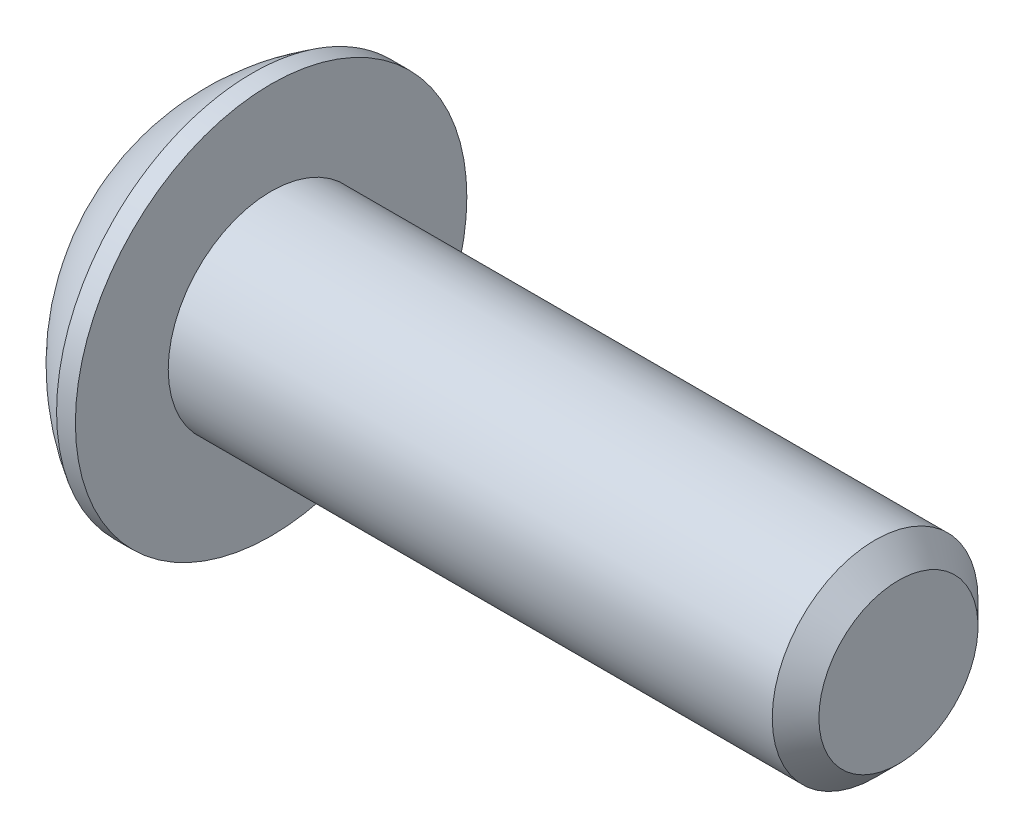
ISO-10303-21;
HEADER;
FILE_DESCRIPTION(('STEP AP214'),'2;1');
FILE_NAME('part.step','',(''),(''),'','','');
FILE_SCHEMA(('AUTOMOTIVE_DESIGN { 1 0 10303 214 1 1 1 1 }'));
ENDSEC;
DATA;
#1=APPLICATION_CONTEXT('core data for automotive mechanical design processes');
#2=APPLICATION_PROTOCOL_DEFINITION('international standard','automotive_design',2000,#1);
#3=PRODUCT_CONTEXT('',#1,'mechanical');
#4=PRODUCT('Part','Part','',(#3));
#5=PRODUCT_RELATED_PRODUCT_CATEGORY('part','',(#4));
#6=PRODUCT_DEFINITION_FORMATION('','',#4);
#7=PRODUCT_DEFINITION_CONTEXT('part definition',#1,'design');
#8=PRODUCT_DEFINITION('design','',#6,#7);
#9=PRODUCT_DEFINITION_SHAPE('','',#8);
#10=(LENGTH_UNIT() NAMED_UNIT(*) SI_UNIT(.MILLI.,.METRE.));
#11=(NAMED_UNIT(*) PLANE_ANGLE_UNIT() SI_UNIT($,.RADIAN.));
#12=(NAMED_UNIT(*) SI_UNIT($,.STERADIAN.) SOLID_ANGLE_UNIT());
#13=UNCERTAINTY_MEASURE_WITH_UNIT(LENGTH_MEASURE(1.E-05),#10,'distance_accuracy_value','');
#14=(GEOMETRIC_REPRESENTATION_CONTEXT(3) GLOBAL_UNCERTAINTY_ASSIGNED_CONTEXT((#13)) GLOBAL_UNIT_ASSIGNED_CONTEXT((#10,
#11,#12)) REPRESENTATION_CONTEXT('',''));
#15=CARTESIAN_POINT('',(0.,0.,0.));
#16=DIRECTION('',(0.,0.,1.));
#17=DIRECTION('',(1.,0.,0.));
#18=AXIS2_PLACEMENT_3D('',#15,#16,#17);
#19=CARTESIAN_POINT('',(1.32080000000034,0.,0.));
#20=DIRECTION('',(-1.,0.,0.));
#21=DIRECTION('',(0.,0.,1.));
#22=AXIS2_PLACEMENT_3D('',#19,#20,#21);
#23=CONICAL_SURFACE('',#22,1.1937999999998,1.04719755119608);
#24=CARTESIAN_POINT('',(2.01004075135902,0.,4.44089209850063E-13));
#25=VERTEX_POINT('',#24);
#26=VERTEX_LOOP('',#25);
#27=FACE_BOUND('',#26,.T.);
#28=CARTESIAN_POINT('',(1.32080000000009,0.,0.));
#29=DIRECTION('',(-1.,0.,0.));
#30=DIRECTION('',(0.,0.,1.));
#31=AXIS2_PLACEMENT_3D('',#28,#29,#30);
#32=CIRCLE('',#31,1.19380000000024);
#33=CARTESIAN_POINT('',(1.32080000000004,0.,1.19380000000012));
#34=VERTEX_POINT('',#33);
#35=CARTESIAN_POINT('',(1.32080000000004,-1.03386112703797,0.596900000000061));
#36=VERTEX_POINT('',#35);
#37=EDGE_CURVE('E20',#34,#36,#32,.F.);
#38=ORIENTED_EDGE('',*,*,#37,.F.);
#39=CARTESIAN_POINT('',(1.32080000000009,0.,0.));
#40=DIRECTION('',(-1.,0.,0.));
#41=DIRECTION('',(0.,0.,1.));
#42=AXIS2_PLACEMENT_3D('',#39,#40,#41);
#43=CIRCLE('',#42,1.19380000000024);
#44=CARTESIAN_POINT('',(1.32080000000004,1.03386112703797,0.596900000000063));
#45=VERTEX_POINT('',#44);
#46=EDGE_CURVE('E90',#45,#34,#43,.F.);
#47=ORIENTED_EDGE('',*,*,#46,.F.);
#48=CARTESIAN_POINT('',(1.32080000000009,0.,0.));
#49=DIRECTION('',(-1.,0.,0.));
#50=DIRECTION('',(0.,0.,1.));
#51=AXIS2_PLACEMENT_3D('',#48,#49,#50);
#52=CIRCLE('',#51,1.19380000000024);
#53=CARTESIAN_POINT('',(1.32080000000004,1.03386112703797,-0.596900000000063));
#54=VERTEX_POINT('',#53);
#55=EDGE_CURVE('E106',#54,#45,#52,.F.);
#56=ORIENTED_EDGE('',*,*,#55,.F.);
#57=CARTESIAN_POINT('',(1.32080000000009,0.,0.));
#58=DIRECTION('',(-1.,0.,0.));
#59=DIRECTION('',(0.,0.,1.));
#60=AXIS2_PLACEMENT_3D('',#57,#58,#59);
#61=CIRCLE('',#60,1.19380000000024);
#62=CARTESIAN_POINT('',(1.32080000000004,1.49420287879031E-12,-1.19380000000012));
#63=VERTEX_POINT('',#62);
#64=EDGE_CURVE('E449',#63,#54,#61,.F.);
#65=ORIENTED_EDGE('',*,*,#64,.F.);
#66=CARTESIAN_POINT('',(1.32080000000009,0.,0.));
#67=DIRECTION('',(-1.,0.,0.));
#68=DIRECTION('',(0.,0.,1.));
#69=AXIS2_PLACEMENT_3D('',#66,#67,#68);
#70=CIRCLE('',#69,1.19380000000024);
#71=CARTESIAN_POINT('',(1.32080000000004,-1.03386112703797,-0.596900000000062));
#72=VERTEX_POINT('',#71);
#73=EDGE_CURVE('E452',#72,#63,#70,.F.);
#74=ORIENTED_EDGE('',*,*,#73,.F.);
#75=CARTESIAN_POINT('',(1.32080000000009,0.,0.));
#76=DIRECTION('',(-1.,0.,0.));
#77=DIRECTION('',(0.,0.,1.));
#78=AXIS2_PLACEMENT_3D('',#75,#76,#77);
#79=CIRCLE('',#78,1.19380000000024);
#80=EDGE_CURVE('E93',#36,#72,#79,.F.);
#81=ORIENTED_EDGE('',*,*,#80,.F.);
#82=EDGE_LOOP('',(#38,#47,#56,#65,#74,#81));
#83=FACE_BOUND('',#82,.T.);
#84=ADVANCED_FACE('F17',(#27,#83),#23,.F.);
#85=CARTESIAN_POINT('',(1.3208,0.,2.3876));
#86=DIRECTION('',(-1.,0.,0.));
#87=DIRECTION('',(0.,0.,1.));
#88=AXIS2_PLACEMENT_3D('',#85,#86,#87);
#89=PLANE('',#88);
#90=DIRECTION('',(0.,1.,0.));
#91=VECTOR('',#90,1.);
#92=CARTESIAN_POINT('',(1.3208,-0.689240751358576,1.1938));
#93=LINE('',#92,#91);
#94=CARTESIAN_POINT('',(1.3208,-0.689240751358576,1.1938));
#95=VERTEX_POINT('',#94);
#96=EDGE_CURVE('E109',#34,#95,#93,.F.);
#97=ORIENTED_EDGE('',*,*,#96,.F.);
#98=ORIENTED_EDGE('',*,*,#37,.T.);
#99=DIRECTION('',(0.,0.5,0.866025403784439));
#100=VECTOR('',#99,1.);
#101=CARTESIAN_POINT('',(1.3208,-1.37848150271715,0.));
#102=LINE('',#101,#100);
#103=EDGE_CURVE('E112',#95,#36,#102,.F.);
#104=ORIENTED_EDGE('',*,*,#103,.F.);
#105=EDGE_LOOP('',(#97,#98,#104));
#106=FACE_BOUND('',#105,.T.);
#107=ADVANCED_FACE('F110',(#106),#89,.T.);
#108=CARTESIAN_POINT('',(1.3208,0.,2.3876));
#109=DIRECTION('',(-1.,0.,0.));
#110=DIRECTION('',(0.,0.,1.));
#111=AXIS2_PLACEMENT_3D('',#108,#109,#110);
#112=PLANE('',#111);
#113=DIRECTION('',(0.,0.5,0.866025403784439));
#114=VECTOR('',#113,1.);
#115=CARTESIAN_POINT('',(1.3208,-1.37848150271715,0.));
#116=LINE('',#115,#114);
#117=CARTESIAN_POINT('',(1.3208,-1.37848150271715,0.));
#118=VERTEX_POINT('',#117);
#119=EDGE_CURVE('E172',#36,#118,#116,.F.);
#120=ORIENTED_EDGE('',*,*,#119,.F.);
#121=ORIENTED_EDGE('',*,*,#80,.T.);
#122=DIRECTION('',(0.,-0.5,0.866025403784439));
#123=VECTOR('',#122,1.);
#124=CARTESIAN_POINT('',(1.3208,-0.689240751358576,-1.1938));
#125=LINE('',#124,#123);
#126=EDGE_CURVE('E160',#118,#72,#125,.F.);
#127=ORIENTED_EDGE('',*,*,#126,.F.);
#128=EDGE_LOOP('',(#120,#121,#127));
#129=FACE_BOUND('',#128,.T.);
#130=ADVANCED_FACE('F249',(#129),#112,.T.);
#131=CARTESIAN_POINT('',(1.3208,0.,2.3876));
#132=DIRECTION('',(-1.,0.,0.));
#133=DIRECTION('',(0.,0.,1.));
#134=AXIS2_PLACEMENT_3D('',#131,#132,#133);
#135=PLANE('',#134);
#136=DIRECTION('',(0.,-0.5,0.866025403784439));
#137=VECTOR('',#136,1.);
#138=CARTESIAN_POINT('',(1.3208,-0.689240751358576,-1.1938));
#139=LINE('',#138,#137);
#140=CARTESIAN_POINT('',(1.3208,-0.689240751358576,-1.1938));
#141=VERTEX_POINT('',#140);
#142=EDGE_CURVE('E157',#72,#141,#139,.F.);
#143=ORIENTED_EDGE('',*,*,#142,.F.);
#144=ORIENTED_EDGE('',*,*,#73,.T.);
#145=DIRECTION('',(0.,-1.,0.));
#146=VECTOR('',#145,1.);
#147=CARTESIAN_POINT('',(1.3208,0.689240751358575,-1.1938));
#148=LINE('',#147,#146);
#149=EDGE_CURVE('E144',#141,#63,#148,.F.);
#150=ORIENTED_EDGE('',*,*,#149,.F.);
#151=EDGE_LOOP('',(#143,#144,#150));
#152=FACE_BOUND('',#151,.T.);
#153=ADVANCED_FACE('F245',(#152),#135,.T.);
#154=CARTESIAN_POINT('',(1.3208,0.,2.3876));
#155=DIRECTION('',(-1.,0.,0.));
#156=DIRECTION('',(0.,0.,1.));
#157=AXIS2_PLACEMENT_3D('',#154,#155,#156);
#158=PLANE('',#157);
#159=DIRECTION('',(0.,-1.,0.));
#160=VECTOR('',#159,1.);
#161=CARTESIAN_POINT('',(1.3208,0.689240751358575,-1.1938));
#162=LINE('',#161,#160);
#163=CARTESIAN_POINT('',(1.3208,0.689240751358575,-1.1938));
#164=VERTEX_POINT('',#163);
#165=EDGE_CURVE('E141',#63,#164,#162,.F.);
#166=ORIENTED_EDGE('',*,*,#165,.F.);
#167=ORIENTED_EDGE('',*,*,#64,.T.);
#168=DIRECTION('',(0.,-0.500000000000001,-0.866025403784438));
#169=VECTOR('',#168,1.);
#170=CARTESIAN_POINT('',(1.3208,1.37848150271715,0.));
#171=LINE('',#170,#169);
#172=EDGE_CURVE('E129',#164,#54,#171,.F.);
#173=ORIENTED_EDGE('',*,*,#172,.F.);
#174=EDGE_LOOP('',(#166,#167,#173));
#175=FACE_BOUND('',#174,.T.);
#176=ADVANCED_FACE('F241',(#175),#158,.T.);
#177=CARTESIAN_POINT('',(1.3208,0.,2.3876));
#178=DIRECTION('',(-1.,0.,0.));
#179=DIRECTION('',(0.,0.,1.));
#180=AXIS2_PLACEMENT_3D('',#177,#178,#179);
#181=PLANE('',#180);
#182=DIRECTION('',(0.,-0.500000000000001,-0.866025403784438));
#183=VECTOR('',#182,1.);
#184=CARTESIAN_POINT('',(1.3208,1.37848150271715,0.));
#185=LINE('',#184,#183);
#186=CARTESIAN_POINT('',(1.3208,1.37848150271715,0.));
#187=VERTEX_POINT('',#186);
#188=EDGE_CURVE('E126',#54,#187,#185,.F.);
#189=ORIENTED_EDGE('',*,*,#188,.F.);
#190=ORIENTED_EDGE('',*,*,#55,.T.);
#191=DIRECTION('',(0.,0.500000000000001,-0.866025403784438));
#192=VECTOR('',#191,1.);
#193=CARTESIAN_POINT('',(1.3208,0.689240751358575,1.1938));
#194=LINE('',#193,#192);
#195=EDGE_CURVE('E149',#187,#45,#194,.F.);
#196=ORIENTED_EDGE('',*,*,#195,.F.);
#197=EDGE_LOOP('',(#189,#190,#196));
#198=FACE_BOUND('',#197,.T.);
#199=ADVANCED_FACE('F238',(#198),#181,.T.);
#200=CARTESIAN_POINT('',(1.3208,0.,2.3876));
#201=DIRECTION('',(-1.,0.,0.));
#202=DIRECTION('',(0.,0.,1.));
#203=AXIS2_PLACEMENT_3D('',#200,#201,#202);
#204=PLANE('',#203);
#205=DIRECTION('',(0.,0.500000000000001,-0.866025403784438));
#206=VECTOR('',#205,1.);
#207=CARTESIAN_POINT('',(1.3208,0.689240751358575,1.1938));
#208=LINE('',#207,#206);
#209=CARTESIAN_POINT('',(1.3208,0.689240751358575,1.1938));
#210=VERTEX_POINT('',#209);
#211=EDGE_CURVE('E104',#45,#210,#208,.F.);
#212=ORIENTED_EDGE('',*,*,#211,.F.);
#213=ORIENTED_EDGE('',*,*,#46,.T.);
#214=DIRECTION('',(0.,1.,0.));
#215=VECTOR('',#214,1.);
#216=CARTESIAN_POINT('',(1.3208,-0.689240751358576,1.1938));
#217=LINE('',#216,#215);
#218=EDGE_CURVE('E101',#210,#34,#217,.F.);
#219=ORIENTED_EDGE('',*,*,#218,.F.);
#220=EDGE_LOOP('',(#212,#213,#219));
#221=FACE_BOUND('',#220,.T.);
#222=ADVANCED_FACE('F99',(#221),#204,.T.);
#223=CARTESIAN_POINT('',(1.3208,-0.689240751358576,1.1938));
#224=DIRECTION('',(0.,0.,-1.));
#225=DIRECTION('',(0.,1.,0.));
#226=AXIS2_PLACEMENT_3D('',#223,#224,#225);
#227=PLANE('',#226);
#228=DIRECTION('',(0.,1.,0.));
#229=VECTOR('',#228,1.);
#230=CARTESIAN_POINT('',(0.,0.,1.1938));
#231=LINE('',#230,#229);
#232=CARTESIAN_POINT('',(0.,0.689240751358575,1.1938));
#233=VERTEX_POINT('',#232);
#234=CARTESIAN_POINT('',(0.,-0.689240751358576,1.1938));
#235=VERTEX_POINT('',#234);
#236=EDGE_CURVE('E133',#233,#235,#231,.F.);
#237=ORIENTED_EDGE('',*,*,#236,.F.);
#238=DIRECTION('',(1.,0.,0.));
#239=VECTOR('',#238,1.);
#240=CARTESIAN_POINT('',(1.3208,0.689240751358575,1.1938));
#241=LINE('',#240,#239);
#242=EDGE_CURVE('E118',#210,#233,#241,.F.);
#243=ORIENTED_EDGE('',*,*,#242,.F.);
#244=ORIENTED_EDGE('',*,*,#218,.T.);
#245=ORIENTED_EDGE('',*,*,#96,.T.);
#246=DIRECTION('',(1.,0.,0.));
#247=VECTOR('',#246,1.);
#248=CARTESIAN_POINT('',(1.3208,-0.689240751358576,1.1938));
#249=LINE('',#248,#247);
#250=EDGE_CURVE('E169',#235,#95,#249,.T.);
#251=ORIENTED_EDGE('',*,*,#250,.F.);
#252=EDGE_LOOP('',(#237,#243,#244,#245,#251));
#253=FACE_BOUND('',#252,.T.);
#254=ADVANCED_FACE('F116',(#253),#227,.T.);
#255=CARTESIAN_POINT('',(1.3208,-1.37848150271715,0.));
#256=DIRECTION('',(0.,0.866025403784439,-0.5));
#257=DIRECTION('',(0.,0.5,0.866025403784439));
#258=AXIS2_PLACEMENT_3D('',#255,#256,#257);
#259=PLANE('',#258);
#260=DIRECTION('',(0.,-0.5,-0.866025403784439));
#261=VECTOR('',#260,1.);
#262=CARTESIAN_POINT('',(0.,-0.689240751358576,1.1938));
#263=LINE('',#262,#261);
#264=CARTESIAN_POINT('',(0.,-1.37848150271715,0.));
#265=VERTEX_POINT('',#264);
#266=EDGE_CURVE('E436',#235,#265,#263,.T.);
#267=ORIENTED_EDGE('',*,*,#266,.F.);
#268=ORIENTED_EDGE('',*,*,#250,.T.);
#269=ORIENTED_EDGE('',*,*,#103,.T.);
#270=ORIENTED_EDGE('',*,*,#119,.T.);
#271=DIRECTION('',(1.,0.,0.));
#272=VECTOR('',#271,1.);
#273=CARTESIAN_POINT('',(1.3208,-1.37848150271715,0.));
#274=LINE('',#273,#272);
#275=EDGE_CURVE('E154',#265,#118,#274,.T.);
#276=ORIENTED_EDGE('',*,*,#275,.F.);
#277=EDGE_LOOP('',(#267,#268,#269,#270,#276));
#278=FACE_BOUND('',#277,.T.);
#279=ADVANCED_FACE('F229',(#278),#259,.T.);
#280=CARTESIAN_POINT('',(1.3208,-0.689240751358576,-1.1938));
#281=DIRECTION('',(0.,0.866025403784439,0.5));
#282=DIRECTION('',(0.,-0.5,0.866025403784439));
#283=AXIS2_PLACEMENT_3D('',#280,#281,#282);
#284=PLANE('',#283);
#285=DIRECTION('',(0.,0.5,-0.866025403784439));
#286=VECTOR('',#285,1.);
#287=CARTESIAN_POINT('',(0.,-1.37848150271715,0.));
#288=LINE('',#287,#286);
#289=CARTESIAN_POINT('',(0.,-0.689240751358576,-1.1938));
#290=VERTEX_POINT('',#289);
#291=EDGE_CURVE('E433',#265,#290,#288,.T.);
#292=ORIENTED_EDGE('',*,*,#291,.F.);
#293=ORIENTED_EDGE('',*,*,#275,.T.);
#294=ORIENTED_EDGE('',*,*,#126,.T.);
#295=ORIENTED_EDGE('',*,*,#142,.T.);
#296=DIRECTION('',(1.,0.,0.));
#297=VECTOR('',#296,1.);
#298=CARTESIAN_POINT('',(1.3208,-0.689240751358576,-1.1938));
#299=LINE('',#298,#297);
#300=EDGE_CURVE('E138',#290,#141,#299,.T.);
#301=ORIENTED_EDGE('',*,*,#300,.F.);
#302=EDGE_LOOP('',(#292,#293,#294,#295,#301));
#303=FACE_BOUND('',#302,.T.);
#304=ADVANCED_FACE('F225',(#303),#284,.T.);
#305=CARTESIAN_POINT('',(1.3208,0.689240751358575,-1.1938));
#306=DIRECTION('',(0.,0.,1.));
#307=DIRECTION('',(0.,-1.,0.));
#308=AXIS2_PLACEMENT_3D('',#305,#306,#307);
#309=PLANE('',#308);
#310=DIRECTION('',(0.,1.,0.));
#311=VECTOR('',#310,1.);
#312=CARTESIAN_POINT('',(0.,0.,-1.1938));
#313=LINE('',#312,#311);
#314=CARTESIAN_POINT('',(0.,0.689240751358575,-1.1938));
#315=VERTEX_POINT('',#314);
#316=EDGE_CURVE('E430',#290,#315,#313,.T.);
#317=ORIENTED_EDGE('',*,*,#316,.F.);
#318=ORIENTED_EDGE('',*,*,#300,.T.);
#319=ORIENTED_EDGE('',*,*,#149,.T.);
#320=ORIENTED_EDGE('',*,*,#165,.T.);
#321=DIRECTION('',(1.,0.,0.));
#322=VECTOR('',#321,1.);
#323=CARTESIAN_POINT('',(1.3208,0.689240751358575,-1.1938));
#324=LINE('',#323,#322);
#325=EDGE_CURVE('E128',#315,#164,#324,.T.);
#326=ORIENTED_EDGE('',*,*,#325,.F.);
#327=EDGE_LOOP('',(#317,#318,#319,#320,#326));
#328=FACE_BOUND('',#327,.T.);
#329=ADVANCED_FACE('F222',(#328),#309,.T.);
#330=CARTESIAN_POINT('',(1.3208,1.37848150271715,0.));
#331=DIRECTION('',(0.,-0.866025403784438,0.500000000000001));
#332=DIRECTION('',(0.,-0.500000000000001,-0.866025403784438));
#333=AXIS2_PLACEMENT_3D('',#330,#331,#332);
#334=PLANE('',#333);
#335=DIRECTION('',(0.,0.500000000000001,0.866025403784438));
#336=VECTOR('',#335,1.);
#337=CARTESIAN_POINT('',(0.,0.689240751358575,-1.1938));
#338=LINE('',#337,#336);
#339=CARTESIAN_POINT('',(0.,1.37848150271715,0.));
#340=VERTEX_POINT('',#339);
#341=EDGE_CURVE('E427',#315,#340,#338,.T.);
#342=ORIENTED_EDGE('',*,*,#341,.F.);
#343=ORIENTED_EDGE('',*,*,#325,.T.);
#344=ORIENTED_EDGE('',*,*,#172,.T.);
#345=ORIENTED_EDGE('',*,*,#188,.T.);
#346=DIRECTION('',(1.,0.,0.));
#347=VECTOR('',#346,1.);
#348=CARTESIAN_POINT('',(1.3208,1.37848150271715,0.));
#349=LINE('',#348,#347);
#350=EDGE_CURVE('E35',#340,#187,#349,.T.);
#351=ORIENTED_EDGE('',*,*,#350,.F.);
#352=EDGE_LOOP('',(#342,#343,#344,#345,#351));
#353=FACE_BOUND('',#352,.T.);
#354=ADVANCED_FACE('F218',(#353),#334,.T.);
#355=CARTESIAN_POINT('',(1.3208,0.689240751358575,1.1938));
#356=DIRECTION('',(0.,-0.866025403784438,-0.500000000000001));
#357=DIRECTION('',(0.,0.500000000000001,-0.866025403784438));
#358=AXIS2_PLACEMENT_3D('',#355,#356,#357);
#359=PLANE('',#358);
#360=DIRECTION('',(0.,-0.500000000000001,0.866025403784438));
#361=VECTOR('',#360,1.);
#362=CARTESIAN_POINT('',(0.,1.37848150271715,0.));
#363=LINE('',#362,#361);
#364=EDGE_CURVE('E204',#340,#233,#363,.T.);
#365=ORIENTED_EDGE('',*,*,#364,.F.);
#366=ORIENTED_EDGE('',*,*,#350,.T.);
#367=ORIENTED_EDGE('',*,*,#195,.T.);
#368=ORIENTED_EDGE('',*,*,#211,.T.);
#369=ORIENTED_EDGE('',*,*,#242,.T.);
#370=EDGE_LOOP('',(#365,#366,#367,#368,#369));
#371=FACE_BOUND('',#370,.T.);
#372=ADVANCED_FACE('F214',(#371),#359,.T.);
#373=CARTESIAN_POINT('',(0.,0.,0.));
#374=DIRECTION('',(-1.,0.,0.));
#375=DIRECTION('',(0.,0.,1.));
#376=AXIS2_PLACEMENT_3D('',#373,#374,#375);
#377=PLANE('',#376);
#378=ORIENTED_EDGE('',*,*,#341,.T.);
#379=ORIENTED_EDGE('',*,*,#364,.T.);
#380=ORIENTED_EDGE('',*,*,#236,.T.);
#381=ORIENTED_EDGE('',*,*,#266,.T.);
#382=ORIENTED_EDGE('',*,*,#291,.T.);
#383=ORIENTED_EDGE('',*,*,#316,.T.);
#384=EDGE_LOOP('',(#378,#379,#380,#381,#382,#383));
#385=FACE_BOUND('',#384,.T.);
#386=CARTESIAN_POINT('',(0.,1.9812,0.));
#387=CARTESIAN_POINT('',(0.,1.9811996664299,0.0556258831179427));
#388=CARTESIAN_POINT('',(0.,1.97885520380442,0.111261989398606));
#389=CARTESIAN_POINT('',(0.,1.96949260169541,0.222149719830457));
#390=CARTESIAN_POINT('',(0.,1.96247308239605,0.277401225602895));
#391=CARTESIAN_POINT('',(0.,1.94379192841038,0.387209508139748));
#392=CARTESIAN_POINT('',(-1.85322082329397E-13,1.93212292489526,0.441765039546366));
#393=CARTESIAN_POINT('',(1.86340500299935E-13,1.90422331175315,0.549729449347494));
#394=CARTESIAN_POINT('',(6.9454332942222E-13,1.88798900035338,0.60313735920887));
#395=CARTESIAN_POINT('',(1.15501983691781E-12,1.832662144765,0.760839131321828));
#396=CARTESIAN_POINT('',(0.,1.78690023648845,0.862876433575428));
#397=CARTESIAN_POINT('',(0.,1.67887358150667,1.05780719540872));
#398=CARTESIAN_POINT('',(9.54250412037226E-13,1.6166082074585,1.15070030720801));
#399=CARTESIAN_POINT('',(5.94776955847561E-13,1.51224157140982,1.28116890915698));
#400=CARTESIAN_POINT('',(1.6313892700342E-13,1.4755970394354,1.32320451127027));
#401=CARTESIAN_POINT('',(-1.62114692902247E-13,1.39893832619713,1.40400288695709));
#402=CARTESIAN_POINT('',(0.,1.35892742784699,1.44276877695455));
#403=CARTESIAN_POINT('',(1.13761909658717E-13,1.23416504602197,1.55382272417904));
#404=CARTESIAN_POINT('',(0.,1.14466125559859,1.62089527952111));
#405=CARTESIAN_POINT('',(0.,0.955712144178163,1.73902218081179));
#406=CARTESIAN_POINT('',(0.,0.85626719823356,1.79007713076007));
#407=CARTESIAN_POINT('',(0.,0.65020634591084,1.87477637530953));
#408=CARTESIAN_POINT('',(0.,0.543590516134852,1.90842085586266));
#409=CARTESIAN_POINT('',(0.,0.326226155292017,1.95733039300656));
#410=CARTESIAN_POINT('',(0.,0.215477602157928,1.97259535144288));
#411=CARTESIAN_POINT('',(0.,-0.00701040587544747,1.98431697865418));
#412=CARTESIAN_POINT('',(0.,-0.118749860774735,1.98077364742916));
#413=CARTESIAN_POINT('',(0.,-0.340050178355486,1.95497485623824));
#414=CARTESIAN_POINT('',(0.,-0.449611052668256,1.93271949620217));
#415=CARTESIAN_POINT('',(0.,-0.663431110729174,1.87014138774524));
#416=CARTESIAN_POINT('',(0.,-0.767690237838521,1.82981844635272));
#417=CARTESIAN_POINT('',(0.,-0.968005760719347,1.73219968377097));
#418=CARTESIAN_POINT('',(0.,-1.0640618469811,1.6749032225164));
#419=CARTESIAN_POINT('',(0.,-1.19980276751283,1.57757371205873));
#420=CARTESIAN_POINT('',(0.,-1.24366557129213,1.54322665019465));
#421=CARTESIAN_POINT('',(0.,-1.32838995706696,1.47093063174263));
#422=CARTESIAN_POINT('',(0.,-1.36924860178706,1.43297823102439));
#423=CARTESIAN_POINT('',(0.,-1.48674671849223,1.31419842051173));
#424=CARTESIAN_POINT('',(0.,-1.55842832343237,1.22836221289312));
#425=CARTESIAN_POINT('',(0.,-1.6863396856475,1.04586168272493));
#426=CARTESIAN_POINT('',(0.,-1.7425700302488,0.949197771949771));
#427=CARTESIAN_POINT('',(0.,-1.8141614250401,0.79818260029868));
#428=CARTESIAN_POINT('',(0.,-1.83591780585875,0.746776203847788));
#429=CARTESIAN_POINT('',(0.,-1.87500754181092,0.642341081688633));
#430=CARTESIAN_POINT('',(0.,-1.89234447645404,0.589313708122844));
#431=CARTESIAN_POINT('',(0.,-1.92246053433555,0.482076273028393));
#432=CARTESIAN_POINT('',(0.,-1.93524685475118,0.427868224257508));
#433=CARTESIAN_POINT('',(0.,-1.95620937250494,0.31857815184461));
#434=CARTESIAN_POINT('',(0.,-1.96438692958147,0.26349639091287));
#435=CARTESIAN_POINT('',(0.,-1.97388528284653,0.173607715038557));
#436=CARTESIAN_POINT('',(0.,-1.97662743364426,0.138944718024997));
#437=CARTESIAN_POINT('',(0.,-1.98028489645283,0.0695224782566998));
#438=CARTESIAN_POINT('',(0.,-1.98120020846367,0.0347632355019629));
#439=CARTESIAN_POINT('',(0.,-1.9811996664299,-0.0556258831179439));
#440=CARTESIAN_POINT('',(0.,-1.97885520380442,-0.111261989398607));
#441=CARTESIAN_POINT('',(0.,-1.96949260169541,-0.222149719830459));
#442=CARTESIAN_POINT('',(0.,-1.96247308239606,-0.277401225602897));
#443=CARTESIAN_POINT('',(0.,-1.94379192841039,-0.387209508139749));
#444=CARTESIAN_POINT('',(-1.85687495073514E-13,-1.93212292489526,-0.441765039546367));
#445=CARTESIAN_POINT('',(1.86706210197E-13,-1.90422331175315,-0.549729449347495));
#446=CARTESIAN_POINT('',(6.95913223380081E-13,-1.88798900035338,-0.603137359208872));
#447=CARTESIAN_POINT('',(1.15748248033081E-12,-1.83266214476501,-0.760839131321831));
#448=CARTESIAN_POINT('',(0.,-1.78690023648846,-0.862876433575432));
#449=CARTESIAN_POINT('',(0.,-1.67887358150667,-1.05780719540872));
#450=CARTESIAN_POINT('',(9.5413180925305E-13,-1.6166082074585,-1.15070030720801));
#451=CARTESIAN_POINT('',(5.94836334946628E-13,-1.51224157140982,-1.28116890915698));
#452=CARTESIAN_POINT('',(1.63155382486304E-13,-1.4755970394354,-1.32320451127027));
#453=CARTESIAN_POINT('',(-1.62131132519566E-13,-1.39893832619713,-1.40400288695709));
#454=CARTESIAN_POINT('',(0.,-1.35892742784699,-1.44276877695455));
#455=CARTESIAN_POINT('',(1.13774829743125E-13,-1.23416504602197,-1.55382272417904));
#456=CARTESIAN_POINT('',(0.,-1.14466125559859,-1.62089527952111));
#457=CARTESIAN_POINT('',(0.,-0.955712144178159,-1.73902218081179));
#458=CARTESIAN_POINT('',(0.,-0.856267198233559,-1.79007713076007));
#459=CARTESIAN_POINT('',(0.,-0.65020634591084,-1.87477637530954));
#460=CARTESIAN_POINT('',(0.,-0.543590516134851,-1.90842085586267));
#461=CARTESIAN_POINT('',(0.,-0.326226155292015,-1.95733039300656));
#462=CARTESIAN_POINT('',(0.,-0.215477602157927,-1.97259535144288));
#463=CARTESIAN_POINT('',(0.,0.00701040587544891,-1.98431697865418));
#464=CARTESIAN_POINT('',(0.,0.118749860774737,-1.98077364742916));
#465=CARTESIAN_POINT('',(0.,0.340050178355488,-1.95497485623824));
#466=CARTESIAN_POINT('',(0.,0.449611052668257,-1.93271949620217));
#467=CARTESIAN_POINT('',(0.,0.663431110729176,-1.87014138774523));
#468=CARTESIAN_POINT('',(0.,0.767690237838524,-1.82981844635272));
#469=CARTESIAN_POINT('',(0.,0.96800576071935,-1.73219968377097));
#470=CARTESIAN_POINT('',(0.,1.0640618469811,-1.6749032225164));
#471=CARTESIAN_POINT('',(0.,1.19980276751283,-1.57757371205873));
#472=CARTESIAN_POINT('',(0.,1.24366557129213,-1.54322665019465));
#473=CARTESIAN_POINT('',(0.,1.32838995706696,-1.47093063174263));
#474=CARTESIAN_POINT('',(0.,1.36924860178706,-1.43297823102439));
#475=CARTESIAN_POINT('',(0.,1.48674671849223,-1.31419842051172));
#476=CARTESIAN_POINT('',(0.,1.55842832343237,-1.22836221289311));
#477=CARTESIAN_POINT('',(0.,1.6863396856475,-1.04586168272493));
#478=CARTESIAN_POINT('',(0.,1.7425700302488,-0.949197771949772));
#479=CARTESIAN_POINT('',(0.,1.8141614250401,-0.798182600298681));
#480=CARTESIAN_POINT('',(0.,1.83591780585875,-0.746776203847787));
#481=CARTESIAN_POINT('',(0.,1.87500754181092,-0.642341081688632));
#482=CARTESIAN_POINT('',(0.,1.89234447645404,-0.589313708122843));
#483=CARTESIAN_POINT('',(0.,1.92246053433555,-0.482076273028391));
#484=CARTESIAN_POINT('',(0.,1.93524685475118,-0.427868224257506));
#485=CARTESIAN_POINT('',(0.,1.95620937250494,-0.318578151844607));
#486=CARTESIAN_POINT('',(0.,1.96438692958147,-0.263496390912867));
#487=CARTESIAN_POINT('',(0.,1.97388528284654,-0.173607715038555));
#488=CARTESIAN_POINT('',(0.,1.97662743364427,-0.138944718024995));
#489=CARTESIAN_POINT('',(0.,1.98028489645283,-0.0695224782566994));
#490=CARTESIAN_POINT('',(0.,1.98120020846367,-0.0347632355019632));
#491=CARTESIAN_POINT('',(0.,1.9812,0.));
#492=B_SPLINE_CURVE_WITH_KNOTS('',3,(#386,#387,#388,#389,#390,#391,#392,#393,#394,#395,#396,
#397,#398,#399,#400,#401,#402,#403,#404,#405,#406,#407,#408,#409,#410,#411,#412,#413,#414,#415,
#416,#417,#418,#419,#420,#421,#422,#423,#424,#425,#426,#427,#428,#429,#430,#431,#432,#433,#434,
#435,#436,#437,#438,#439,#440,#441,#442,#443,#444,#445,#446,#447,#448,#449,#450,#451,#452,#453,
#454,#455,#456,#457,#458,#459,#460,#461,#462,#463,#464,#465,#466,#467,#468,#469,#470,#471,#472,
#473,#474,#475,#476,#477,#478,#479,#480,#481,#482,#483,#484,#485,#486,#487,#488,#489,#490,#491),
.UNSPECIFIED.,.T.,.F.,(4,2,2,2,2,2,2,2,2,2,2,2,2,2,2,2,2,2,2,2,2,2,2,2,2,2,2,2,2,2,2,2,2,2,2,2,
2,2,2,2,2,2,2,2,2,2,2,2,2,2,2,2,4),(0.,0.166845646007828,0.333740557374255,0.500901034367694,
0.668197445942387,1.00199278686282,1.33580081809885,1.50292354032982,1.6698851310853,
2.00370118900129,2.33750465770544,2.67130456115909,3.00510624723801,3.33890793331696,
3.67270783677065,4.00651130547476,4.34032736339026,4.50728895414554,4.67441167637632,
5.00821970761259,5.34201504853332,5.50931146010827,5.67647193710191,5.84336684846844,
6.0102124944764,6.11448220058334,6.21875190669029,6.38559755269812,6.55249246406454,
6.71965294105798,6.88694935263267,7.22074469355311,7.55455272478914,7.72167544702011,
7.88863703777559,8.22245309569158,8.55625656439573,8.89005646784938,9.2238581539283,
9.55765984000725,9.89145974346094,10.225263212165,10.5590792700806,10.7260408608358,
10.8931635830666,11.2269716143029,11.5607669552236,11.7280633667986,11.8952238437922,
12.0621187551587,12.2289644011667,12.3332341072736,12.4375038133806),.UNSPECIFIED.);
#493=CARTESIAN_POINT('',(0.,1.9812,0.));
#494=VERTEX_POINT('',#493);
#495=EDGE_CURVE('E198',#494,#494,#492,.T.);
#496=ORIENTED_EDGE('',*,*,#495,.F.);
#497=EDGE_LOOP('',(#496));
#498=FACE_BOUND('',#497,.T.);
#499=ADVANCED_FACE('F210',(#385,#498),#377,.T.);
#500=CARTESIAN_POINT('',(4.13385,0.,0.));
#501=DIRECTION('',(0.,1.,0.));
#502=DIRECTION('',(1.,0.,0.));
#503=AXIS2_PLACEMENT_3D('',#500,#501,#502);
#504=SPHERICAL_SURFACE('',#503,4.58408870578439);
#505=CARTESIAN_POINT('',(1.8288,0.,0.));
#506=DIRECTION('',(-1.,0.,0.));
#507=DIRECTION('',(0.,0.,1.));
#508=AXIS2_PLACEMENT_3D('',#505,#506,#507);
#509=CIRCLE('',#508,3.9624);
#510=CARTESIAN_POINT('',(1.8288,0.,3.9624));
#511=VERTEX_POINT('',#510);
#512=EDGE_CURVE('E195',#511,#511,#509,.F.);
#513=ORIENTED_EDGE('',*,*,#512,.F.);
#514=EDGE_LOOP('',(#513));
#515=FACE_BOUND('',#514,.T.);
#516=ORIENTED_EDGE('',*,*,#495,.T.);
#517=EDGE_LOOP('',(#516));
#518=FACE_BOUND('',#517,.T.);
#519=ADVANCED_FACE('F206',(#515,#518),#504,.T.);
#520=CARTESIAN_POINT('',(14.9098,0.,0.));
#521=DIRECTION('',(-1.,0.,0.));
#522=DIRECTION('',(0.,0.,1.));
#523=AXIS2_PLACEMENT_3D('',#520,#521,#522);
#524=PLANE('',#523);
#525=CARTESIAN_POINT('',(14.9098000000549,0.,0.));
#526=DIRECTION('',(-1.,0.,0.));
#527=DIRECTION('',(0.,0.,1.));
#528=AXIS2_PLACEMENT_3D('',#525,#526,#527);
#529=CIRCLE('',#528,1.61036000002923);
#530=CARTESIAN_POINT('',(14.9098000000549,0.,1.61036000002923));
#531=VERTEX_POINT('',#530);
#532=EDGE_CURVE('E192',#531,#531,#529,.T.);
#533=ORIENTED_EDGE('',*,*,#532,.F.);
#534=EDGE_LOOP('',(#533));
#535=FACE_BOUND('',#534,.T.);
#536=ADVANCED_FACE('F277',(#535),#524,.F.);
#537=CARTESIAN_POINT('',(0.,0.,0.));
#538=DIRECTION('',(-1.,0.,0.));
#539=DIRECTION('',(0.,0.,1.));
#540=AXIS2_PLACEMENT_3D('',#537,#538,#539);
#541=CYLINDRICAL_SURFACE('',#540,3.9624);
#542=ORIENTED_EDGE('',*,*,#512,.T.);
#543=EDGE_LOOP('',(#542));
#544=FACE_BOUND('',#543,.T.);
#545=CARTESIAN_POINT('',(2.2098,0.,0.));
#546=DIRECTION('',(-1.,0.,0.));
#547=DIRECTION('',(0.,0.,1.));
#548=AXIS2_PLACEMENT_3D('',#545,#546,#547);
#549=CIRCLE('',#548,3.9624);
#550=CARTESIAN_POINT('',(2.2098,0.,3.9624));
#551=VERTEX_POINT('',#550);
#552=EDGE_CURVE('E189',#551,#551,#549,.T.);
#553=ORIENTED_EDGE('',*,*,#552,.T.);
#554=EDGE_LOOP('',(#553));
#555=FACE_BOUND('',#554,.T.);
#556=ADVANCED_FACE('F274',(#544,#555),#541,.T.);
#557=CARTESIAN_POINT('',(14.4373599999881,0.,0.));
#558=DIRECTION('',(-1.,0.,0.));
#559=DIRECTION('',(0.,0.,1.));
#560=AXIS2_PLACEMENT_3D('',#557,#558,#559);
#561=CONICAL_SURFACE('',#560,2.08280000003924,0.785398163337289);
#562=CARTESIAN_POINT('',(14.43736,0.,0.));
#563=DIRECTION('',(-1.,0.,0.));
#564=DIRECTION('',(0.,0.,1.));
#565=AXIS2_PLACEMENT_3D('',#562,#563,#564);
#566=CIRCLE('',#565,2.0828);
#567=CARTESIAN_POINT('',(14.43736,0.,2.0828));
#568=VERTEX_POINT('',#567);
#569=EDGE_CURVE('E26',#568,#568,#566,.T.);
#570=ORIENTED_EDGE('',*,*,#569,.F.);
#571=EDGE_LOOP('',(#570));
#572=FACE_BOUND('',#571,.T.);
#573=ORIENTED_EDGE('',*,*,#532,.T.);
#574=EDGE_LOOP('',(#573));
#575=FACE_BOUND('',#574,.T.);
#576=ADVANCED_FACE('F267',(#572,#575),#561,.T.);
#577=CARTESIAN_POINT('',(2.2098,2.0828,0.));
#578=DIRECTION('',(-1.,0.,0.));
#579=DIRECTION('',(0.,0.,1.));
#580=AXIS2_PLACEMENT_3D('',#577,#578,#579);
#581=PLANE('',#580);
#582=CARTESIAN_POINT('',(2.2098,0.,0.));
#583=DIRECTION('',(-1.,0.,0.));
#584=DIRECTION('',(0.,0.,1.));
#585=AXIS2_PLACEMENT_3D('',#582,#583,#584);
#586=CIRCLE('',#585,2.0828);
#587=CARTESIAN_POINT('',(2.2098,0.,2.0828));
#588=VERTEX_POINT('',#587);
#589=EDGE_CURVE('E11',#588,#588,#586,.F.);
#590=ORIENTED_EDGE('',*,*,#589,.F.);
#591=EDGE_LOOP('',(#590));
#592=FACE_BOUND('',#591,.T.);
#593=ORIENTED_EDGE('',*,*,#552,.F.);
#594=EDGE_LOOP('',(#593));
#595=FACE_BOUND('',#594,.T.);
#596=ADVANCED_FACE('F261',(#592,#595),#581,.F.);
#597=CARTESIAN_POINT('',(0.,0.,0.));
#598=DIRECTION('',(-1.,0.,0.));
#599=DIRECTION('',(0.,0.,1.));
#600=AXIS2_PLACEMENT_3D('',#597,#598,#599);
#601=CYLINDRICAL_SURFACE('',#600,2.0828);
#602=ORIENTED_EDGE('',*,*,#589,.T.);
#603=EDGE_LOOP('',(#602));
#604=FACE_BOUND('',#603,.T.);
#605=ORIENTED_EDGE('',*,*,#569,.T.);
#606=EDGE_LOOP('',(#605));
#607=FACE_BOUND('',#606,.T.);
#608=ADVANCED_FACE('F259',(#604,#607),#601,.T.);
#609=CLOSED_SHELL('',(#84,#107,#130,#153,#176,#199,#222,#254,#279,#304,#329,#354,#372,#499,#519,
#536,#556,#576,#596,#608));
#610=MANIFOLD_SOLID_BREP('B1',#609);
#611=ADVANCED_BREP_SHAPE_REPRESENTATION('',(#18,#610),#14);
#612=SHAPE_DEFINITION_REPRESENTATION(#9,#611);
ENDSEC;
END-ISO-10303-21;
